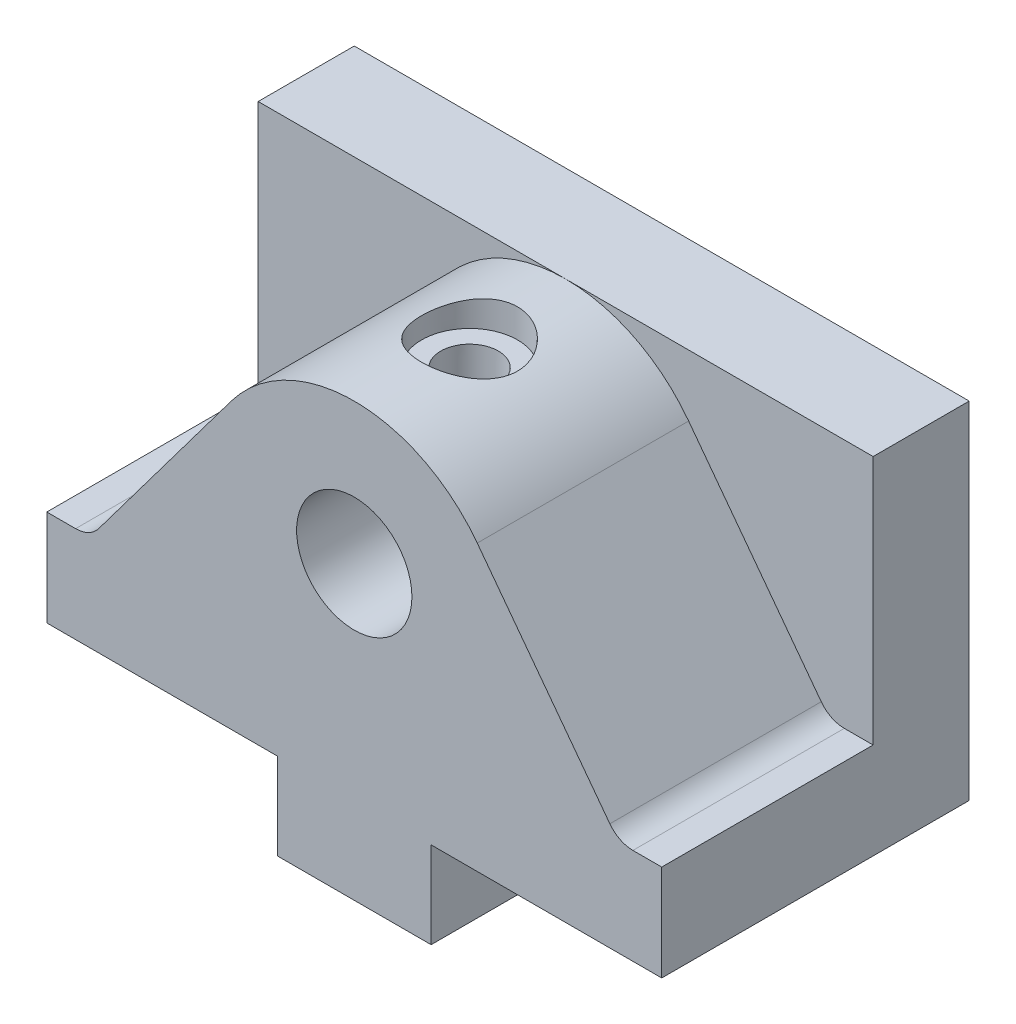
ISO-10303-21;
HEADER;
FILE_DESCRIPTION(('STEP AP214'),'2;1');
FILE_NAME('part.step','',(''),(''),'','','');
FILE_SCHEMA(('AUTOMOTIVE_DESIGN { 1 0 10303 214 1 1 1 1 }'));
ENDSEC;
DATA;
#1=APPLICATION_CONTEXT('core data for automotive mechanical design processes');
#2=APPLICATION_PROTOCOL_DEFINITION('international standard','automotive_design',2000,#1);
#3=PRODUCT_CONTEXT('',#1,'mechanical');
#4=PRODUCT('Part','Part','',(#3));
#5=PRODUCT_RELATED_PRODUCT_CATEGORY('part','',(#4));
#6=PRODUCT_DEFINITION_FORMATION('','',#4);
#7=PRODUCT_DEFINITION_CONTEXT('part definition',#1,'design');
#8=PRODUCT_DEFINITION('design','',#6,#7);
#9=PRODUCT_DEFINITION_SHAPE('','',#8);
#10=(LENGTH_UNIT() NAMED_UNIT(*) SI_UNIT(.MILLI.,.METRE.));
#11=(NAMED_UNIT(*) PLANE_ANGLE_UNIT() SI_UNIT($,.RADIAN.));
#12=(NAMED_UNIT(*) SI_UNIT($,.STERADIAN.) SOLID_ANGLE_UNIT());
#13=UNCERTAINTY_MEASURE_WITH_UNIT(LENGTH_MEASURE(1.E-05),#10,'distance_accuracy_value','');
#14=(GEOMETRIC_REPRESENTATION_CONTEXT(3) GLOBAL_UNCERTAINTY_ASSIGNED_CONTEXT((#13)) GLOBAL_UNIT_ASSIGNED_CONTEXT((#10,
#11,#12)) REPRESENTATION_CONTEXT('',''));
#15=CARTESIAN_POINT('',(0.,0.,0.));
#16=DIRECTION('',(0.,0.,1.));
#17=DIRECTION('',(1.,0.,0.));
#18=AXIS2_PLACEMENT_3D('',#15,#16,#17);
#19=CARTESIAN_POINT('',(-32.,41.,-6.));
#20=DIRECTION('',(0.,0.,-1.));
#21=DIRECTION('',(-1.,0.,0.));
#22=AXIS2_PLACEMENT_3D('',#19,#20,#21);
#23=PLANE('',#22);
#24=DIRECTION('',(-0.6,0.8,0.));
#25=VECTOR('',#24,1.);
#26=CARTESIAN_POINT('',(12.8,34.6,-6.00000000000001));
#27=LINE('',#26,#25);
#28=CARTESIAN_POINT('',(26.6,16.2,-6.00000000000001));
#29=VERTEX_POINT('',#28);
#30=CARTESIAN_POINT('',(12.8,34.6,-6.));
#31=VERTEX_POINT('',#30);
#32=EDGE_CURVE('E230',#29,#31,#27,.T.);
#33=ORIENTED_EDGE('',*,*,#32,.F.);
#34=CARTESIAN_POINT('',(29.,18.,-6.));
#35=DIRECTION('',(0.,0.,-1.));
#36=DIRECTION('',(-1.,0.,0.));
#37=AXIS2_PLACEMENT_3D('',#34,#35,#36);
#38=CIRCLE('',#37,3.);
#39=CARTESIAN_POINT('',(29.,15.,-6.));
#40=VERTEX_POINT('',#39);
#41=EDGE_CURVE('E384',#29,#40,#38,.F.);
#42=ORIENTED_EDGE('',*,*,#41,.T.);
#43=DIRECTION('',(-1.,0.,0.));
#44=VECTOR('',#43,1.);
#45=CARTESIAN_POINT('',(-32.,15.,-6.));
#46=LINE('',#45,#44);
#47=CARTESIAN_POINT('',(32.,15.,-6.));
#48=VERTEX_POINT('',#47);
#49=EDGE_CURVE('E261',#48,#40,#46,.T.);
#50=ORIENTED_EDGE('',*,*,#49,.F.);
#51=DIRECTION('',(0.,-1.,0.));
#52=VECTOR('',#51,1.);
#53=CARTESIAN_POINT('',(32.,41.,-6.));
#54=LINE('',#53,#52);
#55=CARTESIAN_POINT('',(32.,41.,-6.));
#56=VERTEX_POINT('',#55);
#57=EDGE_CURVE('E277',#56,#48,#54,.T.);
#58=ORIENTED_EDGE('',*,*,#57,.F.);
#59=DIRECTION('',(1.,0.,0.));
#60=VECTOR('',#59,1.);
#61=CARTESIAN_POINT('',(-32.,41.,-6.));
#62=LINE('',#61,#60);
#63=CARTESIAN_POINT('',(0.,41.,-6.));
#64=VERTEX_POINT('',#63);
#65=EDGE_CURVE('E267',#64,#56,#62,.T.);
#66=ORIENTED_EDGE('',*,*,#65,.F.);
#67=CARTESIAN_POINT('',(0.,25.,-6.00000000000001));
#68=DIRECTION('',(0.,0.,1.));
#69=DIRECTION('',(1.,0.,0.));
#70=AXIS2_PLACEMENT_3D('',#67,#68,#69);
#71=CIRCLE('',#70,16.);
#72=EDGE_CURVE('E234',#31,#64,#71,.T.);
#73=ORIENTED_EDGE('',*,*,#72,.F.);
#74=EDGE_LOOP('',(#33,#42,#50,#58,#66,#73));
#75=FACE_BOUND('',#74,.T.);
#76=ADVANCED_FACE('F35',(#75),#23,.F.);
#77=CARTESIAN_POINT('',(0.,15.,0.));
#78=DIRECTION('',(0.,1.,0.));
#79=DIRECTION('',(0.,0.,1.));
#80=AXIS2_PLACEMENT_3D('',#77,#78,#79);
#81=PLANE('',#80);
#82=ORIENTED_EDGE('',*,*,#49,.T.);
#83=DIRECTION('',(0.,0.,1.));
#84=VECTOR('',#83,1.);
#85=CARTESIAN_POINT('',(29.,15.,16.));
#86=LINE('',#85,#84);
#87=CARTESIAN_POINT('',(29.,15.,16.));
#88=VERTEX_POINT('',#87);
#89=EDGE_CURVE('E377',#40,#88,#86,.T.);
#90=ORIENTED_EDGE('',*,*,#89,.T.);
#91=DIRECTION('',(1.,0.,0.));
#92=VECTOR('',#91,1.);
#93=CARTESIAN_POINT('',(-32.,15.,16.));
#94=LINE('',#93,#92);
#95=CARTESIAN_POINT('',(32.,15.,16.));
#96=VERTEX_POINT('',#95);
#97=EDGE_CURVE('E254',#88,#96,#94,.T.);
#98=ORIENTED_EDGE('',*,*,#97,.T.);
#99=DIRECTION('',(0.,0.,-1.));
#100=VECTOR('',#99,1.);
#101=CARTESIAN_POINT('',(32.,15.,-6.));
#102=LINE('',#101,#100);
#103=EDGE_CURVE('E258',#96,#48,#102,.T.);
#104=ORIENTED_EDGE('',*,*,#103,.T.);
#105=EDGE_LOOP('',(#82,#90,#98,#104));
#106=FACE_BOUND('',#105,.T.);
#107=ADVANCED_FACE('F339',(#106),#81,.T.);
#108=CARTESIAN_POINT('',(32.,5.,16.));
#109=DIRECTION('',(-1.,0.,0.));
#110=DIRECTION('',(0.,0.,1.));
#111=AXIS2_PLACEMENT_3D('',#108,#109,#110);
#112=PLANE('',#111);
#113=DIRECTION('',(0.,-1.,0.));
#114=VECTOR('',#113,1.);
#115=CARTESIAN_POINT('',(32.,5.,16.));
#116=LINE('',#115,#114);
#117=CARTESIAN_POINT('',(32.,5.,16.));
#118=VERTEX_POINT('',#117);
#119=EDGE_CURVE('E278',#96,#118,#116,.T.);
#120=ORIENTED_EDGE('',*,*,#119,.T.);
#121=DIRECTION('',(0.,0.,1.));
#122=VECTOR('',#121,1.);
#123=CARTESIAN_POINT('',(32.,5.,-17.));
#124=LINE('',#123,#122);
#125=CARTESIAN_POINT('',(32.,5.,-16.));
#126=VERTEX_POINT('',#125);
#127=EDGE_CURVE('E211',#126,#118,#124,.T.);
#128=ORIENTED_EDGE('',*,*,#127,.F.);
#129=DIRECTION('',(0.,-1.,0.));
#130=VECTOR('',#129,1.);
#131=CARTESIAN_POINT('',(32.,5.,-16.));
#132=LINE('',#131,#130);
#133=CARTESIAN_POINT('',(32.,41.,-16.));
#134=VERTEX_POINT('',#133);
#135=EDGE_CURVE('E288',#134,#126,#132,.T.);
#136=ORIENTED_EDGE('',*,*,#135,.F.);
#137=DIRECTION('',(0.,0.,-1.));
#138=VECTOR('',#137,1.);
#139=CARTESIAN_POINT('',(32.,41.,-16.));
#140=LINE('',#139,#138);
#141=EDGE_CURVE('E271',#56,#134,#140,.T.);
#142=ORIENTED_EDGE('',*,*,#141,.F.);
#143=ORIENTED_EDGE('',*,*,#57,.T.);
#144=ORIENTED_EDGE('',*,*,#103,.F.);
#145=EDGE_LOOP('',(#120,#128,#136,#142,#143,#144));
#146=FACE_BOUND('',#145,.T.);
#147=ADVANCED_FACE('F347',(#146),#112,.F.);
#148=CARTESIAN_POINT('',(-32.,5.,-16.));
#149=DIRECTION('',(0.,0.,1.));
#150=DIRECTION('',(1.,0.,0.));
#151=AXIS2_PLACEMENT_3D('',#148,#149,#150);
#152=PLANE('',#151);
#153=DIRECTION('',(0.,1.,0.));
#154=VECTOR('',#153,1.);
#155=CARTESIAN_POINT('',(-8.,5.,-16.));
#156=LINE('',#155,#154);
#157=CARTESIAN_POINT('',(-8.,-4.,-16.));
#158=VERTEX_POINT('',#157);
#159=CARTESIAN_POINT('',(-8.,5.,-16.));
#160=VERTEX_POINT('',#159);
#161=EDGE_CURVE('E223',#158,#160,#156,.T.);
#162=ORIENTED_EDGE('',*,*,#161,.T.);
#163=DIRECTION('',(-1.,0.,0.));
#164=VECTOR('',#163,1.);
#165=CARTESIAN_POINT('',(-32.,5.,-16.));
#166=LINE('',#165,#164);
#167=CARTESIAN_POINT('',(-32.,5.,-16.));
#168=VERTEX_POINT('',#167);
#169=EDGE_CURVE('E226',#160,#168,#166,.T.);
#170=ORIENTED_EDGE('',*,*,#169,.T.);
#171=DIRECTION('',(0.,-1.,0.));
#172=VECTOR('',#171,1.);
#173=CARTESIAN_POINT('',(-32.,5.,-16.));
#174=LINE('',#173,#172);
#175=CARTESIAN_POINT('',(-32.,41.,-16.));
#176=VERTEX_POINT('',#175);
#177=EDGE_CURVE('E285',#176,#168,#174,.T.);
#178=ORIENTED_EDGE('',*,*,#177,.F.);
#179=DIRECTION('',(-1.,0.,0.));
#180=VECTOR('',#179,1.);
#181=CARTESIAN_POINT('',(-32.,41.,-16.));
#182=LINE('',#181,#180);
#183=EDGE_CURVE('E274',#134,#176,#182,.T.);
#184=ORIENTED_EDGE('',*,*,#183,.F.);
#185=ORIENTED_EDGE('',*,*,#135,.T.);
#186=DIRECTION('',(-1.,0.,0.));
#187=VECTOR('',#186,1.);
#188=CARTESIAN_POINT('',(-32.,5.,-16.));
#189=LINE('',#188,#187);
#190=CARTESIAN_POINT('',(8.,5.,-16.));
#191=VERTEX_POINT('',#190);
#192=EDGE_CURVE('E204',#126,#191,#189,.T.);
#193=ORIENTED_EDGE('',*,*,#192,.T.);
#194=DIRECTION('',(0.,-1.,0.));
#195=VECTOR('',#194,1.);
#196=CARTESIAN_POINT('',(8.,5.,-16.));
#197=LINE('',#196,#195);
#198=CARTESIAN_POINT('',(8.,-4.,-16.));
#199=VERTEX_POINT('',#198);
#200=EDGE_CURVE('E217',#191,#199,#197,.T.);
#201=ORIENTED_EDGE('',*,*,#200,.T.);
#202=DIRECTION('',(-1.,0.,0.));
#203=VECTOR('',#202,1.);
#204=CARTESIAN_POINT('',(-32.,-4.,-16.));
#205=LINE('',#204,#203);
#206=EDGE_CURVE('E220',#199,#158,#205,.T.);
#207=ORIENTED_EDGE('',*,*,#206,.T.);
#208=EDGE_LOOP('',(#162,#170,#178,#184,#185,#193,#201,#207));
#209=FACE_BOUND('',#208,.T.);
#210=ADVANCED_FACE('F414',(#209),#152,.F.);
#211=CARTESIAN_POINT('',(-32.,5.,16.));
#212=DIRECTION('',(1.,0.,0.));
#213=DIRECTION('',(0.,0.,-1.));
#214=AXIS2_PLACEMENT_3D('',#211,#212,#213);
#215=PLANE('',#214);
#216=ORIENTED_EDGE('',*,*,#177,.T.);
#217=DIRECTION('',(0.,0.,1.));
#218=VECTOR('',#217,1.);
#219=CARTESIAN_POINT('',(-32.,5.,-17.));
#220=LINE('',#219,#218);
#221=CARTESIAN_POINT('',(-32.,5.,16.));
#222=VERTEX_POINT('',#221);
#223=EDGE_CURVE('E201',#168,#222,#220,.T.);
#224=ORIENTED_EDGE('',*,*,#223,.T.);
#225=DIRECTION('',(0.,-1.,0.));
#226=VECTOR('',#225,1.);
#227=CARTESIAN_POINT('',(-32.,5.,16.));
#228=LINE('',#227,#226);
#229=CARTESIAN_POINT('',(-32.,15.,16.));
#230=VERTEX_POINT('',#229);
#231=EDGE_CURVE('E281',#230,#222,#228,.T.);
#232=ORIENTED_EDGE('',*,*,#231,.F.);
#233=DIRECTION('',(0.,0.,1.));
#234=VECTOR('',#233,1.);
#235=CARTESIAN_POINT('',(-32.,15.,-6.));
#236=LINE('',#235,#234);
#237=CARTESIAN_POINT('',(-32.,15.,-6.));
#238=VERTEX_POINT('',#237);
#239=EDGE_CURVE('E249',#238,#230,#236,.T.);
#240=ORIENTED_EDGE('',*,*,#239,.F.);
#241=DIRECTION('',(0.,-1.,0.));
#242=VECTOR('',#241,1.);
#243=CARTESIAN_POINT('',(-32.,41.,-6.));
#244=LINE('',#243,#242);
#245=CARTESIAN_POINT('',(-32.,41.,-6.));
#246=VERTEX_POINT('',#245);
#247=EDGE_CURVE('E282',#246,#238,#244,.T.);
#248=ORIENTED_EDGE('',*,*,#247,.F.);
#249=DIRECTION('',(0.,0.,1.));
#250=VECTOR('',#249,1.);
#251=CARTESIAN_POINT('',(-32.,41.,-16.));
#252=LINE('',#251,#250);
#253=EDGE_CURVE('E264',#176,#246,#252,.T.);
#254=ORIENTED_EDGE('',*,*,#253,.F.);
#255=EDGE_LOOP('',(#216,#224,#232,#240,#248,#254));
#256=FACE_BOUND('',#255,.T.);
#257=ADVANCED_FACE('F363',(#256),#215,.F.);
#258=CARTESIAN_POINT('',(-32.,5.,16.));
#259=DIRECTION('',(0.,0.,-1.));
#260=DIRECTION('',(-1.,0.,0.));
#261=AXIS2_PLACEMENT_3D('',#258,#259,#260);
#262=PLANE('',#261);
#263=CARTESIAN_POINT('',(0.,26.35,16.));
#264=DIRECTION('',(0.,0.,1.));
#265=DIRECTION('',(1.,0.,0.));
#266=AXIS2_PLACEMENT_3D('',#263,#264,#265);
#267=CIRCLE('',#266,6.);
#268=CARTESIAN_POINT('',(6.,26.35,16.));
#269=VERTEX_POINT('',#268);
#270=EDGE_CURVE('E181',#269,#269,#267,.T.);
#271=ORIENTED_EDGE('',*,*,#270,.F.);
#272=EDGE_LOOP('',(#271));
#273=FACE_BOUND('',#272,.T.);
#274=ORIENTED_EDGE('',*,*,#231,.T.);
#275=DIRECTION('',(-1.,0.,0.));
#276=VECTOR('',#275,1.);
#277=CARTESIAN_POINT('',(-32.,5.,16.));
#278=LINE('',#277,#276);
#279=CARTESIAN_POINT('',(-8.,5.,16.));
#280=VERTEX_POINT('',#279);
#281=EDGE_CURVE('E185',#280,#222,#278,.T.);
#282=ORIENTED_EDGE('',*,*,#281,.F.);
#283=DIRECTION('',(0.,1.,0.));
#284=VECTOR('',#283,1.);
#285=CARTESIAN_POINT('',(-8.,5.,16.));
#286=LINE('',#285,#284);
#287=CARTESIAN_POINT('',(-8.,-4.,16.));
#288=VERTEX_POINT('',#287);
#289=EDGE_CURVE('E198',#288,#280,#286,.T.);
#290=ORIENTED_EDGE('',*,*,#289,.F.);
#291=DIRECTION('',(-1.,0.,0.));
#292=VECTOR('',#291,1.);
#293=CARTESIAN_POINT('',(-8.,-4.,16.));
#294=LINE('',#293,#292);
#295=CARTESIAN_POINT('',(8.,-4.,16.));
#296=VERTEX_POINT('',#295);
#297=EDGE_CURVE('E195',#296,#288,#294,.T.);
#298=ORIENTED_EDGE('',*,*,#297,.F.);
#299=DIRECTION('',(0.,-1.,0.));
#300=VECTOR('',#299,1.);
#301=CARTESIAN_POINT('',(8.,-4.,16.));
#302=LINE('',#301,#300);
#303=CARTESIAN_POINT('',(8.,5.,16.));
#304=VERTEX_POINT('',#303);
#305=EDGE_CURVE('E192',#304,#296,#302,.T.);
#306=ORIENTED_EDGE('',*,*,#305,.F.);
#307=DIRECTION('',(-1.,0.,0.));
#308=VECTOR('',#307,1.);
#309=CARTESIAN_POINT('',(8.,5.,16.));
#310=LINE('',#309,#308);
#311=EDGE_CURVE('E189',#118,#304,#310,.T.);
#312=ORIENTED_EDGE('',*,*,#311,.F.);
#313=ORIENTED_EDGE('',*,*,#119,.F.);
#314=ORIENTED_EDGE('',*,*,#97,.F.);
#315=CARTESIAN_POINT('',(29.,18.,16.));
#316=DIRECTION('',(0.,0.,-1.));
#317=DIRECTION('',(-1.,0.,0.));
#318=AXIS2_PLACEMENT_3D('',#315,#316,#317);
#319=CIRCLE('',#318,3.);
#320=CARTESIAN_POINT('',(26.6,16.2,16.));
#321=VERTEX_POINT('',#320);
#322=EDGE_CURVE('E11',#88,#321,#319,.T.);
#323=ORIENTED_EDGE('',*,*,#322,.T.);
#324=DIRECTION('',(-0.6,0.8,0.));
#325=VECTOR('',#324,1.);
#326=CARTESIAN_POINT('',(12.8,34.6,16.));
#327=LINE('',#326,#325);
#328=CARTESIAN_POINT('',(12.8,34.6,16.));
#329=VERTEX_POINT('',#328);
#330=EDGE_CURVE('E229',#321,#329,#327,.T.);
#331=ORIENTED_EDGE('',*,*,#330,.T.);
#332=CARTESIAN_POINT('',(0.,25.,16.));
#333=DIRECTION('',(0.,0.,1.));
#334=DIRECTION('',(1.,0.,0.));
#335=AXIS2_PLACEMENT_3D('',#332,#333,#334);
#336=CIRCLE('',#335,16.);
#337=CARTESIAN_POINT('',(-12.8,34.6,16.));
#338=VERTEX_POINT('',#337);
#339=EDGE_CURVE('E242',#329,#338,#336,.T.);
#340=ORIENTED_EDGE('',*,*,#339,.T.);
#341=DIRECTION('',(-0.6,-0.8,0.));
#342=VECTOR('',#341,1.);
#343=CARTESIAN_POINT('',(-12.8,34.6,16.));
#344=LINE('',#343,#342);
#345=CARTESIAN_POINT('',(-26.6,16.2,16.));
#346=VERTEX_POINT('',#345);
#347=EDGE_CURVE('E233',#338,#346,#344,.T.);
#348=ORIENTED_EDGE('',*,*,#347,.T.);
#349=CARTESIAN_POINT('',(-29.,18.,16.));
#350=DIRECTION('',(0.,0.,-1.));
#351=DIRECTION('',(-1.,0.,0.));
#352=AXIS2_PLACEMENT_3D('',#349,#350,#351);
#353=CIRCLE('',#352,3.);
#354=CARTESIAN_POINT('',(-29.,15.,16.));
#355=VERTEX_POINT('',#354);
#356=EDGE_CURVE('E43',#346,#355,#353,.T.);
#357=ORIENTED_EDGE('',*,*,#356,.T.);
#358=EDGE_CURVE('E255',#230,#355,#94,.T.);
#359=ORIENTED_EDGE('',*,*,#358,.F.);
#360=EDGE_LOOP('',(#274,#282,#290,#298,#306,#312,#313,#314,#323,#331,#340,#348,#357,#359));
#361=FACE_BOUND('',#360,.T.);
#362=ADVANCED_FACE('F355',(#273,#361),#262,.F.);
#363=CARTESIAN_POINT('',(-29.,15.,-6.));
#364=VERTEX_POINT('',#363);
#365=EDGE_CURVE('E260',#364,#238,#46,.T.);
#366=ORIENTED_EDGE('',*,*,#365,.F.);
#367=CARTESIAN_POINT('',(-29.,18.,-6.));
#368=DIRECTION('',(0.,0.,-1.));
#369=DIRECTION('',(-1.,0.,0.));
#370=AXIS2_PLACEMENT_3D('',#367,#368,#369);
#371=CIRCLE('',#370,3.);
#372=CARTESIAN_POINT('',(-26.6,16.2,-6.00000000000001));
#373=VERTEX_POINT('',#372);
#374=EDGE_CURVE('E367',#364,#373,#371,.F.);
#375=ORIENTED_EDGE('',*,*,#374,.T.);
#376=DIRECTION('',(-0.6,-0.8,0.));
#377=VECTOR('',#376,1.);
#378=CARTESIAN_POINT('',(-12.8,34.6,-6.00000000000001));
#379=LINE('',#378,#377);
#380=CARTESIAN_POINT('',(-12.8,34.6,-6.));
#381=VERTEX_POINT('',#380);
#382=EDGE_CURVE('E237',#381,#373,#379,.T.);
#383=ORIENTED_EDGE('',*,*,#382,.F.);
#384=EDGE_CURVE('E232',#64,#381,#71,.T.);
#385=ORIENTED_EDGE('',*,*,#384,.F.);
#386=EDGE_CURVE('E268',#246,#64,#62,.T.);
#387=ORIENTED_EDGE('',*,*,#386,.F.);
#388=ORIENTED_EDGE('',*,*,#247,.T.);
#389=EDGE_LOOP('',(#366,#375,#383,#385,#387,#388));
#390=FACE_BOUND('',#389,.T.);
#391=ADVANCED_FACE('F342',(#390),#23,.F.);
#392=CARTESIAN_POINT('',(0.,41.,0.));
#393=DIRECTION('',(0.,1.,0.));
#394=DIRECTION('',(0.,0.,1.));
#395=AXIS2_PLACEMENT_3D('',#392,#393,#394);
#396=PLANE('',#395);
#397=ORIENTED_EDGE('',*,*,#253,.T.);
#398=ORIENTED_EDGE('',*,*,#386,.T.);
#399=ORIENTED_EDGE('',*,*,#65,.T.);
#400=ORIENTED_EDGE('',*,*,#141,.T.);
#401=ORIENTED_EDGE('',*,*,#183,.T.);
#402=EDGE_LOOP('',(#397,#398,#399,#400,#401));
#403=FACE_BOUND('',#402,.T.);
#404=ADVANCED_FACE('F354',(#403),#396,.T.);
#405=ORIENTED_EDGE('',*,*,#358,.T.);
#406=DIRECTION('',(0.,0.,1.));
#407=VECTOR('',#406,1.);
#408=CARTESIAN_POINT('',(-29.,15.,-6.));
#409=LINE('',#408,#407);
#410=EDGE_CURVE('E375',#355,#364,#409,.F.);
#411=ORIENTED_EDGE('',*,*,#410,.T.);
#412=ORIENTED_EDGE('',*,*,#365,.T.);
#413=ORIENTED_EDGE('',*,*,#239,.T.);
#414=EDGE_LOOP('',(#405,#411,#412,#413));
#415=FACE_BOUND('',#414,.T.);
#416=ADVANCED_FACE('F350',(#415),#81,.T.);
#417=CARTESIAN_POINT('',(12.8,34.6,-6.00000000000001));
#418=DIRECTION('',(0.8,0.6,0.));
#419=DIRECTION('',(-0.6,0.8,0.));
#420=AXIS2_PLACEMENT_3D('',#417,#418,#419);
#421=PLANE('',#420);
#422=ORIENTED_EDGE('',*,*,#330,.F.);
#423=DIRECTION('',(0.,0.,1.));
#424=VECTOR('',#423,1.);
#425=CARTESIAN_POINT('',(26.6,16.2,-6.));
#426=LINE('',#425,#424);
#427=EDGE_CURVE('E50',#321,#29,#426,.F.);
#428=ORIENTED_EDGE('',*,*,#427,.T.);
#429=ORIENTED_EDGE('',*,*,#32,.T.);
#430=DIRECTION('',(0.,0.,1.));
#431=VECTOR('',#430,1.);
#432=CARTESIAN_POINT('',(12.8,34.6,-6.00000000000001));
#433=LINE('',#432,#431);
#434=EDGE_CURVE('E240',#31,#329,#433,.T.);
#435=ORIENTED_EDGE('',*,*,#434,.T.);
#436=EDGE_LOOP('',(#422,#428,#429,#435));
#437=FACE_BOUND('',#436,.T.);
#438=ADVANCED_FACE('F467',(#437),#421,.T.);
#439=CARTESIAN_POINT('',(-12.8,34.6,-6.00000000000001));
#440=DIRECTION('',(-0.8,0.6,0.));
#441=DIRECTION('',(-0.6,-0.8,0.));
#442=AXIS2_PLACEMENT_3D('',#439,#440,#441);
#443=PLANE('',#442);
#444=ORIENTED_EDGE('',*,*,#382,.T.);
#445=DIRECTION('',(0.,0.,1.));
#446=VECTOR('',#445,1.);
#447=CARTESIAN_POINT('',(-26.6,16.2,16.));
#448=LINE('',#447,#446);
#449=EDGE_CURVE('E291',#373,#346,#448,.T.);
#450=ORIENTED_EDGE('',*,*,#449,.T.);
#451=ORIENTED_EDGE('',*,*,#347,.F.);
#452=DIRECTION('',(0.,0.,1.));
#453=VECTOR('',#452,1.);
#454=CARTESIAN_POINT('',(-12.8,34.6,-6.00000000000001));
#455=LINE('',#454,#453);
#456=EDGE_CURVE('E247',#381,#338,#455,.T.);
#457=ORIENTED_EDGE('',*,*,#456,.F.);
#458=EDGE_LOOP('',(#444,#450,#451,#457));
#459=FACE_BOUND('',#458,.T.);
#460=ADVANCED_FACE('F475',(#459),#443,.T.);
#461=CARTESIAN_POINT('',(0.,25.,-6.00000000000001));
#462=DIRECTION('',(0.,0.,1.));
#463=DIRECTION('',(1.,0.,0.));
#464=AXIS2_PLACEMENT_3D('',#461,#462,#463);
#465=CYLINDRICAL_SURFACE('',#464,16.);
#466=CARTESIAN_POINT('',(-3.66796682288666,40.5738890257447,0.607329849351256));
#467=CARTESIAN_POINT('',(-3.85655415549104,40.5294745982076,0.811224864187316));
#468=CARTESIAN_POINT('',(-4.02817473890282,40.4854332584185,1.03092758181053));
#469=CARTESIAN_POINT('',(-4.33293183524669,40.4029447642242,1.49656247220712));
#470=CARTESIAN_POINT('',(-4.46606775554461,40.364497695971,1.7424950488203));
#471=CARTESIAN_POINT('',(-4.69004570726828,40.297622038454,2.25480624263852));
#472=CARTESIAN_POINT('',(-4.78081015389734,40.2692118502867,2.52122133420603));
#473=CARTESIAN_POINT('',(-4.91643951138088,40.2260885888312,3.06653593579446));
#474=CARTESIAN_POINT('',(-4.96131927802489,40.21137108249,3.34543137458969));
#475=CARTESIAN_POINT('',(-5.00275228367461,40.1977933086947,3.89782050917656));
#476=CARTESIAN_POINT('',(-5.00086291536524,40.1984220089563,4.17118543221788));
#477=CARTESIAN_POINT('',(-4.95265932790622,40.2141969995065,4.71352303427987));
#478=CARTESIAN_POINT('',(-4.90634658042497,40.2293428088689,4.98249585850283));
#479=CARTESIAN_POINT('',(-4.77211202907309,40.2719267196872,5.5040761899871));
#480=CARTESIAN_POINT('',(-4.68487703648901,40.2991615361199,5.75687833085505));
#481=CARTESIAN_POINT('',(-4.4718452406259,40.3627763863686,6.24442736484907));
#482=CARTESIAN_POINT('',(-4.34604075877108,40.3991582409556,6.4791706510912));
#483=CARTESIAN_POINT('',(-4.05386221880599,40.4786923427116,6.93360886435161));
#484=CARTESIAN_POINT('',(-3.88612912720647,40.522049206833,7.15239399033943));
#485=CARTESIAN_POINT('',(-3.51714621075486,40.6097916357537,7.55940674307296));
#486=CARTESIAN_POINT('',(-3.31588857897941,40.6541774380864,7.74762723196419));
#487=CARTESIAN_POINT('',(-2.87738820576906,40.7407803072445,8.09457883429065));
#488=CARTESIAN_POINT('',(-2.63915908314209,40.7828733605562,8.25209815876441));
#489=CARTESIAN_POINT('',(-2.13829349418781,40.8584911314616,8.52471533434713));
#490=CARTESIAN_POINT('',(-1.87566069399767,40.8920171332451,8.63981954457108));
#491=CARTESIAN_POINT('',(-1.33873476430424,40.9461312533402,8.82187666301131));
#492=CARTESIAN_POINT('',(-1.06477380238511,40.9669615185857,8.88973453887428));
#493=CARTESIAN_POINT('',(-0.508667532018523,40.9943319850915,8.97838472749205));
#494=CARTESIAN_POINT('',(-0.226524571763152,41.0008762460307,8.99919041121106));
#495=CARTESIAN_POINT('',(0.325842585700283,40.9989715262755,8.99308388543464));
#496=CARTESIAN_POINT('',(0.596091722753742,40.9911123227242,8.96804875217832));
#497=CARTESIAN_POINT('',(1.12830301167268,40.9623923802865,8.87482225570158));
#498=CARTESIAN_POINT('',(1.39026514982239,40.9415316198825,8.80663082105729));
#499=CARTESIAN_POINT('',(1.89863960138947,40.889005690702,8.62946373639845));
#500=CARTESIAN_POINT('',(2.14506044687401,40.8573465124552,8.52051069605052));
#501=CARTESIAN_POINT('',(2.61643251582556,40.7864235664649,8.2650993545443));
#502=CARTESIAN_POINT('',(2.84137905702392,40.7471581458801,8.11863289946439));
#503=CARTESIAN_POINT('',(3.27291517406224,40.6632777226258,7.7856111128247));
#504=CARTESIAN_POINT('',(3.47843333606935,40.6185129660826,7.59770447809671));
#505=CARTESIAN_POINT('',(3.85559410407518,40.529713974528,7.19030478403674));
#506=CARTESIAN_POINT('',(4.02722960110405,40.4856798945923,6.97080511279371));
#507=CARTESIAN_POINT('',(4.33571732769096,40.4022001949091,6.50001920657609));
#508=CARTESIAN_POINT('',(4.47164450786056,40.3628887210636,6.24810079152894));
#509=CARTESIAN_POINT('',(4.69886772258125,40.2949276618799,5.72354402818869));
#510=CARTESIAN_POINT('',(4.79017615573699,40.2662751151805,5.45091146027934));
#511=CARTESIAN_POINT('',(4.92275537918722,40.2240342090441,4.90152408257693));
#512=CARTESIAN_POINT('',(4.96548021525487,40.2100092017545,4.62515463500765));
#513=CARTESIAN_POINT('',(5.0042052969101,40.1973150930097,4.06884257127003));
#514=CARTESIAN_POINT('',(5.00021766461478,40.1986420076536,3.78890090094679));
#515=CARTESIAN_POINT('',(4.94678936830576,40.2161086592355,3.24502113153351));
#516=CARTESIAN_POINT('',(4.89913560932645,40.2316660144151,2.98088573469236));
#517=CARTESIAN_POINT('',(4.76258749721299,40.2749087949847,2.46455786653337));
#518=CARTESIAN_POINT('',(4.6736886514883,40.3025955415414,2.21236669953067));
#519=CARTESIAN_POINT('',(4.45579853143224,40.3674625704678,1.72259363559533));
#520=CARTESIAN_POINT('',(4.32621270209906,40.4047820741446,1.48529546240047));
#521=CARTESIAN_POINT('',(4.03105187982965,40.4846356718916,1.03520969572654));
#522=CARTESIAN_POINT('',(3.86546750796661,40.5271711236441,0.822428511958623));
#523=CARTESIAN_POINT('',(3.49409961311753,40.615032346554,0.417243749289483));
#524=CARTESIAN_POINT('',(3.28682923537477,40.6603969926424,0.226208801913236));
#525=CARTESIAN_POINT('',(2.8426047421488,40.7470868147152,-0.118713694769998));
#526=CARTESIAN_POINT('',(2.60564856122262,40.7884117092701,-0.27259865711744));
#527=CARTESIAN_POINT('',(2.1063085549053,40.8627725048384,-0.539673431803767));
#528=CARTESIAN_POINT('',(1.84375402108608,40.8957466178422,-0.652562430848433));
#529=CARTESIAN_POINT('',(1.30211291584888,40.9492454737118,-0.832170286852407));
#530=CARTESIAN_POINT('',(1.02303142936766,40.9697740241504,-0.898903265581839));
#531=CARTESIAN_POINT('',(0.467886770182546,40.9954771427218,-0.982029654847181));
#532=CARTESIAN_POINT('',(0.192126760684001,41.0012166393071,-1.00027610119662));
#533=CARTESIAN_POINT('',(-0.358534516756937,40.9983506775733,-0.991099921477244));
#534=CARTESIAN_POINT('',(-0.633435895370321,40.9897471514506,-0.963683446813018));
#535=CARTESIAN_POINT('',(-1.16762038897196,40.9595288267538,-0.865446388170668));
#536=CARTESIAN_POINT('',(-1.42712081414383,40.9382359579645,-0.795698963678337));
#537=CARTESIAN_POINT('',(-1.93066376578296,40.8851089751851,-0.616066690796061));
#538=CARTESIAN_POINT('',(-2.17470490941603,40.8532739197772,-0.50617825772126));
#539=CARTESIAN_POINT('',(-2.64318938431321,40.7819580072738,-0.248501567848817));
#540=CARTESIAN_POINT('',(-2.86746136570034,40.7424183406304,-0.100418762890941));
#541=CARTESIAN_POINT('',(-3.28905847148391,40.6597673082255,0.229329320975597));
#542=CARTESIAN_POINT('',(-3.48637806045092,40.6166552116777,0.411001480422211));
#543=CARTESIAN_POINT('',(-3.66796682288666,40.5738890257447,0.607329849351256));
#544=B_SPLINE_CURVE_WITH_KNOTS('',3,(#466,#467,#468,#469,#470,#471,#472,#473,#474,#475,#476,
#477,#478,#479,#480,#481,#482,#483,#484,#485,#486,#487,#488,#489,#490,#491,#492,#493,#494,#495,
#496,#497,#498,#499,#500,#501,#502,#503,#504,#505,#506,#507,#508,#509,#510,#511,#512,#513,#514,
#515,#516,#517,#518,#519,#520,#521,#522,#523,#524,#525,#526,#527,#528,#529,#530,#531,#532,#533,
#534,#535,#536,#537,#538,#539,#540,#541,#542,#543),.UNSPECIFIED.,.T.,.F.,(4,2,2,2,2,2,2,2,2,2,2,
2,2,2,2,2,2,2,2,2,2,2,2,2,2,2,2,2,2,2,2,2,2,2,2,2,2,2,4),(0.,0.842878534632082,1.68577004825268,
2.53019895271362,3.37435437516618,4.19043878081383,5.00649615195451,5.80932222040629,
6.61230822274298,7.44578312799107,8.27945239816324,9.14130003440096,10.0030184049203,
10.8477400236091,11.6922215650127,12.5028935954864,13.3135669676293,14.1237913401663,
14.9341919728767,15.7764988348789,16.6189822350851,17.481516473694,18.3438108958203,
19.179556256138,20.0150847411973,20.8178784261168,21.6207595752809,22.4359667291507,
23.2513865291451,24.103927220286,24.9565272614513,25.8152626613844,26.6737352086142,
27.4988928798011,28.323939400233,29.1288957874737,29.9339240767613,30.7453565670626,
31.5569554580049),.UNSPECIFIED.);
#545=CARTESIAN_POINT('',(-3.66796682288666,40.5738890257447,0.607329849351256));
#546=VERTEX_POINT('',#545);
#547=EDGE_CURVE('E164',#546,#546,#544,.T.);
#548=ORIENTED_EDGE('',*,*,#547,.F.);
#549=EDGE_LOOP('',(#548));
#550=FACE_BOUND('',#549,.T.);
#551=ORIENTED_EDGE('',*,*,#339,.F.);
#552=ORIENTED_EDGE('',*,*,#434,.F.);
#553=ORIENTED_EDGE('',*,*,#72,.T.);
#554=ORIENTED_EDGE('',*,*,#384,.T.);
#555=ORIENTED_EDGE('',*,*,#456,.T.);
#556=EDGE_LOOP('',(#551,#552,#553,#554,#555));
#557=FACE_BOUND('',#556,.T.);
#558=ADVANCED_FACE('F484',(#550,#557),#465,.T.);
#559=CARTESIAN_POINT('',(-32.,5.,-17.));
#560=DIRECTION('',(0.,1.,0.));
#561=DIRECTION('',(0.,0.,1.));
#562=AXIS2_PLACEMENT_3D('',#559,#560,#561);
#563=PLANE('',#562);
#564=DIRECTION('',(0.,0.,1.));
#565=VECTOR('',#564,1.);
#566=CARTESIAN_POINT('',(-8.,5.,-17.));
#567=LINE('',#566,#565);
#568=EDGE_CURVE('E202',#160,#280,#567,.T.);
#569=ORIENTED_EDGE('',*,*,#568,.T.);
#570=ORIENTED_EDGE('',*,*,#281,.T.);
#571=ORIENTED_EDGE('',*,*,#223,.F.);
#572=ORIENTED_EDGE('',*,*,#169,.F.);
#573=EDGE_LOOP('',(#569,#570,#571,#572));
#574=FACE_BOUND('',#573,.T.);
#575=ADVANCED_FACE('F393',(#574),#563,.F.);
#576=CARTESIAN_POINT('',(-8.,5.,-17.));
#577=DIRECTION('',(1.,0.,0.));
#578=DIRECTION('',(0.,0.,-1.));
#579=AXIS2_PLACEMENT_3D('',#576,#577,#578);
#580=PLANE('',#579);
#581=DIRECTION('',(0.,0.,1.));
#582=VECTOR('',#581,1.);
#583=CARTESIAN_POINT('',(-8.,-4.,-17.));
#584=LINE('',#583,#582);
#585=EDGE_CURVE('E205',#158,#288,#584,.T.);
#586=ORIENTED_EDGE('',*,*,#585,.T.);
#587=ORIENTED_EDGE('',*,*,#289,.T.);
#588=ORIENTED_EDGE('',*,*,#568,.F.);
#589=ORIENTED_EDGE('',*,*,#161,.F.);
#590=EDGE_LOOP('',(#586,#587,#588,#589));
#591=FACE_BOUND('',#590,.T.);
#592=ADVANCED_FACE('F396',(#591),#580,.F.);
#593=CARTESIAN_POINT('',(-8.,-4.,-17.));
#594=DIRECTION('',(0.,1.,0.));
#595=DIRECTION('',(0.,0.,1.));
#596=AXIS2_PLACEMENT_3D('',#593,#594,#595);
#597=PLANE('',#596);
#598=CARTESIAN_POINT('',(0.,-4.,-8.));
#599=DIRECTION('',(0.,-1.,0.));
#600=DIRECTION('',(0.,0.,-1.));
#601=AXIS2_PLACEMENT_3D('',#598,#599,#600);
#602=CIRCLE('',#601,3.);
#603=CARTESIAN_POINT('',(0.,-4.,-11.));
#604=VERTEX_POINT('',#603);
#605=EDGE_CURVE('E163',#604,#604,#602,.T.);
#606=ORIENTED_EDGE('',*,*,#605,.F.);
#607=EDGE_LOOP('',(#606));
#608=FACE_BOUND('',#607,.T.);
#609=CARTESIAN_POINT('',(0.,-4.,8.));
#610=DIRECTION('',(0.,-1.,0.));
#611=DIRECTION('',(0.,0.,-1.));
#612=AXIS2_PLACEMENT_3D('',#609,#610,#611);
#613=CIRCLE('',#612,3.);
#614=CARTESIAN_POINT('',(0.,-4.,5.));
#615=VERTEX_POINT('',#614);
#616=EDGE_CURVE('E178',#615,#615,#613,.T.);
#617=ORIENTED_EDGE('',*,*,#616,.F.);
#618=EDGE_LOOP('',(#617));
#619=FACE_BOUND('',#618,.T.);
#620=DIRECTION('',(0.,0.,1.));
#621=VECTOR('',#620,1.);
#622=CARTESIAN_POINT('',(8.,-4.,-17.));
#623=LINE('',#622,#621);
#624=EDGE_CURVE('E207',#199,#296,#623,.T.);
#625=ORIENTED_EDGE('',*,*,#624,.T.);
#626=ORIENTED_EDGE('',*,*,#297,.T.);
#627=ORIENTED_EDGE('',*,*,#585,.F.);
#628=ORIENTED_EDGE('',*,*,#206,.F.);
#629=EDGE_LOOP('',(#625,#626,#627,#628));
#630=FACE_BOUND('',#629,.T.);
#631=ADVANCED_FACE('F399',(#608,#619,#630),#597,.F.);
#632=CARTESIAN_POINT('',(8.,-4.,-17.));
#633=DIRECTION('',(-1.,0.,0.));
#634=DIRECTION('',(0.,0.,1.));
#635=AXIS2_PLACEMENT_3D('',#632,#633,#634);
#636=PLANE('',#635);
#637=DIRECTION('',(0.,0.,1.));
#638=VECTOR('',#637,1.);
#639=CARTESIAN_POINT('',(8.,5.,-17.));
#640=LINE('',#639,#638);
#641=EDGE_CURVE('E209',#191,#304,#640,.T.);
#642=ORIENTED_EDGE('',*,*,#641,.T.);
#643=ORIENTED_EDGE('',*,*,#305,.T.);
#644=ORIENTED_EDGE('',*,*,#624,.F.);
#645=ORIENTED_EDGE('',*,*,#200,.F.);
#646=EDGE_LOOP('',(#642,#643,#644,#645));
#647=FACE_BOUND('',#646,.T.);
#648=ADVANCED_FACE('F405',(#647),#636,.F.);
#649=CARTESIAN_POINT('',(8.,5.,-17.));
#650=DIRECTION('',(0.,1.,0.));
#651=DIRECTION('',(0.,0.,1.));
#652=AXIS2_PLACEMENT_3D('',#649,#650,#651);
#653=PLANE('',#652);
#654=ORIENTED_EDGE('',*,*,#127,.T.);
#655=ORIENTED_EDGE('',*,*,#311,.T.);
#656=ORIENTED_EDGE('',*,*,#641,.F.);
#657=ORIENTED_EDGE('',*,*,#192,.F.);
#658=EDGE_LOOP('',(#654,#655,#656,#657));
#659=FACE_BOUND('',#658,.T.);
#660=ADVANCED_FACE('F336',(#659),#653,.F.);
#661=CARTESIAN_POINT('',(0.,26.35,-8.));
#662=DIRECTION('',(0.,0.,1.));
#663=DIRECTION('',(1.,0.,0.));
#664=AXIS2_PLACEMENT_3D('',#661,#662,#663);
#665=CYLINDRICAL_SURFACE('',#664,6.);
#666=CARTESIAN_POINT('',(-2.17228207507304,31.9429590188304,1.93495668051628));
#667=CARTESIAN_POINT('',(-2.28590294147616,31.8988268963375,2.05463969501388));
#668=CARTESIAN_POINT('',(-2.38971423988232,31.8545075977372,2.18378134357558));
#669=CARTESIAN_POINT('',(-2.57534574851252,31.7701516407487,2.45856993016285));
#670=CARTESIAN_POINT('',(-2.6571290171592,31.7301222434808,2.60424401928418));
#671=CARTESIAN_POINT('',(-2.79631678962924,31.6591213778755,2.90985048633608));
#672=CARTESIAN_POINT('',(-2.85360750545873,31.6281923912045,3.06984532630991));
#673=CARTESIAN_POINT('',(-2.94047677468444,31.5803083167896,3.39906619659786));
#674=CARTESIAN_POINT('',(-2.97009901961994,31.5633312026267,3.56827722476864));
#675=CARTESIAN_POINT('',(-2.99858195377174,31.5469931216537,3.89453344158444));
#676=CARTESIAN_POINT('',(-2.99999709071706,31.5461694164228,4.05128415607862));
#677=CARTESIAN_POINT('',(-2.97847328597131,31.5585358631155,4.36254510020766));
#678=CARTESIAN_POINT('',(-2.95553194255265,31.5717273970446,4.51705510736933));
#679=CARTESIAN_POINT('',(-2.88844447151177,31.6091098597056,4.81073964973844));
#680=CARTESIAN_POINT('',(-2.845546543973,31.6326493374844,4.95028932290435));
#681=CARTESIAN_POINT('',(-2.74073918137653,31.687774937791,5.22033238412854));
#682=CARTESIAN_POINT('',(-2.67882381079058,31.7193635720132,5.3508229291338));
#683=CARTESIAN_POINT('',(-2.53061015904541,31.7909026161315,5.61308146247724));
#684=CARTESIAN_POINT('',(-2.44249659022767,31.8313726593386,5.74368022594591));
#685=CARTESIAN_POINT('',(-2.24731206846635,31.9142461442681,5.98922059428091));
#686=CARTESIAN_POINT('',(-2.14022890501248,31.9566508181582,6.10415202944042));
#687=CARTESIAN_POINT('',(-1.89703797106335,32.0438195980049,6.32722563480906));
#688=CARTESIAN_POINT('',(-1.75907489014901,32.0883751775677,6.43344119759992));
#689=CARTESIAN_POINT('',(-1.4652958945906,32.170319950321,6.62115814183567));
#690=CARTESIAN_POINT('',(-1.30948383563888,32.2077106865965,6.70266484700783));
#691=CARTESIAN_POINT('',(-0.989059712493417,32.2700958253365,6.83561638055946));
#692=CARTESIAN_POINT('',(-0.824878118017784,32.2954428907144,6.88792549402761));
#693=CARTESIAN_POINT('',(-0.488544009538195,32.3324623096037,6.96371202128267));
#694=CARTESIAN_POINT('',(-0.316398346625282,32.3441461975606,6.98721375504967));
#695=CARTESIAN_POINT('',(0.0124151233773963,32.3520148493568,7.00327220391182));
#696=CARTESIAN_POINT('',(0.168916421499579,32.3496276935307,6.99867844746814));
#697=CARTESIAN_POINT('',(0.478652094989291,32.3328868597318,6.96534703882998));
#698=CARTESIAN_POINT('',(0.631886692357146,32.3185339976072,6.93661103270607));
#699=CARTESIAN_POINT('',(0.927135572367335,32.2797625663165,6.85728455221813));
#700=CARTESIAN_POINT('',(1.06933172388373,32.2555962124863,6.80724025936646));
#701=CARTESIAN_POINT('',(1.34334583225101,32.1993596369387,6.68724169789093));
#702=CARTESIAN_POINT('',(1.47516133431549,32.1672875530582,6.61728273784515));
#703=CARTESIAN_POINT('',(1.73566557237392,32.0951815220793,6.45336418177985));
#704=CARTESIAN_POINT('',(1.86333467317617,32.0547250107466,6.35797282716165));
#705=CARTESIAN_POINT('',(2.10164604647802,31.9713037697378,6.14869242322328));
#706=CARTESIAN_POINT('',(2.21227575638656,31.9283372213781,6.03478985212923));
#707=CARTESIAN_POINT('',(2.42355587960155,31.8400484398047,5.77967249246007));
#708=CARTESIAN_POINT('',(2.52241732890762,31.7948612759328,5.63692342077703));
#709=CARTESIAN_POINT('',(2.69475885023551,31.7116678934944,5.33474999480434));
#710=CARTESIAN_POINT('',(2.76824512958174,31.6736599197721,5.17532973110417));
#711=CARTESIAN_POINT('',(2.85624888514898,31.6266366065343,4.92930622890725));
#712=CARTESIAN_POINT('',(2.88166172471601,31.6127604984451,4.847392248668));
#713=CARTESIAN_POINT('',(2.92546267746741,31.5885397152286,4.68121426888402));
#714=CARTESIAN_POINT('',(2.9438545458983,31.5781931525995,4.59695155154054));
#715=CARTESIAN_POINT('',(2.97332676356569,31.5614890908544,4.42683737030157));
#716=CARTESIAN_POINT('',(2.98441348015646,31.555128118036,4.34098735722292));
#717=CARTESIAN_POINT('',(2.99912674557352,31.5466624189697,4.16847155268648));
#718=CARTESIAN_POINT('',(3.0027542916812,31.5445571237439,4.08180587183909));
#719=CARTESIAN_POINT('',(3.00234770514801,31.5448034933104,3.84384520053472));
#720=CARTESIAN_POINT('',(2.99059774918381,31.5516408848631,3.69247582572438));
#721=CARTESIAN_POINT('',(2.94469057769122,31.5777575855087,3.39437756268797));
#722=CARTESIAN_POINT('',(2.91052768211428,31.5970400485012,3.24764986067122));
#723=CARTESIAN_POINT('',(2.82188919541895,31.6452271516336,2.96419754153411));
#724=CARTESIAN_POINT('',(2.76766327391709,31.6740130727876,2.82737371049343));
#725=CARTESIAN_POINT('',(2.6406291522169,31.7381469813049,2.56433550375605));
#726=CARTESIAN_POINT('',(2.56781410066556,31.7734973868127,2.43812506266184));
#727=CARTESIAN_POINT('',(2.39539472291432,31.8520081587014,2.18360863456221));
#728=CARTESIAN_POINT('',(2.29361143158065,31.8955956705864,2.05690799590695));
#729=CARTESIAN_POINT('',(2.07088822256051,31.9825590423987,1.82144342128483));
#730=CARTESIAN_POINT('',(1.94993662679101,32.025934756576,1.71269050276297));
#731=CARTESIAN_POINT('',(1.6814265290085,32.1114293888311,1.50821013304227));
#732=CARTESIAN_POINT('',(1.5325598614089,32.153216375636,1.41404741772671));
#733=CARTESIAN_POINT('',(1.21871978802342,32.2271286691884,1.25255316109054));
#734=CARTESIAN_POINT('',(1.05375582589602,32.2592595961646,1.18520600455218));
#735=CARTESIAN_POINT('',(0.723531456505979,32.3084012193443,1.08384249833439));
#736=CARTESIAN_POINT('',(0.558971652577076,32.3262510459468,1.04796199742096));
#737=CARTESIAN_POINT('',(0.225306730305603,32.3480926737023,1.00431164832084));
#738=CARTESIAN_POINT('',(0.0562049510324651,32.3520943888079,0.996521689765004));
#739=CARTESIAN_POINT('',(-0.265214096090779,32.346094584854,1.00884275988923));
#740=CARTESIAN_POINT('',(-0.417657657314605,32.3373349475177,1.02647785978492));
#741=CARTESIAN_POINT('',(-0.717132589563809,32.3088883509927,1.08446651321198));
#742=CARTESIAN_POINT('',(-0.864162053505948,32.2891975799063,1.12482799194121));
#743=CARTESIAN_POINT('',(-1.14999321684723,32.2405606555472,1.22697262794716));
#744=CARTESIAN_POINT('',(-1.28873414491815,32.2115542183324,1.28889554054518));
#745=CARTESIAN_POINT('',(-1.55400170638435,32.1468698989807,1.43202802388922));
#746=CARTESIAN_POINT('',(-1.68053952506266,32.1111982159945,1.5132196921307));
#747=CARTESIAN_POINT('',(-1.86661191853097,32.0526898431301,1.65315216801936));
#748=CARTESIAN_POINT('',(-1.93108287988545,32.0311315728931,1.70600043570363));
#749=CARTESIAN_POINT('',(-2.05529346574463,31.9873843913563,1.81675084191706));
#750=CARTESIAN_POINT('',(-2.11503297584653,31.9651954648253,1.87465310257671));
#751=CARTESIAN_POINT('',(-2.17228207507304,31.9429590188304,1.93495668051628));
#752=B_SPLINE_CURVE_WITH_KNOTS('',3,(#666,#667,#668,#669,#670,#671,#672,#673,#674,#675,#676,
#677,#678,#679,#680,#681,#682,#683,#684,#685,#686,#687,#688,#689,#690,#691,#692,#693,#694,#695,
#696,#697,#698,#699,#700,#701,#702,#703,#704,#705,#706,#707,#708,#709,#710,#711,#712,#713,#714,
#715,#716,#717,#718,#719,#720,#721,#722,#723,#724,#725,#726,#727,#728,#729,#730,#731,#732,#733,
#734,#735,#736,#737,#738,#739,#740,#741,#742,#743,#744,#745,#746,#747,#748,#749,#750,#751),
.UNSPECIFIED.,.T.,.F.,(4,2,2,2,2,2,2,2,2,2,2,2,2,2,2,2,2,2,2,2,2,2,2,2,2,2,2,2,2,2,2,2,2,2,2,2,
2,2,2,2,2,2,4),(0.,0.512188845299913,1.02523137075442,1.54063215946002,2.05521769117916,
2.5229668531789,2.9907621429607,3.4325816085771,3.87453911069325,4.36055081162041,
4.84687649703249,5.38342139672165,5.91985061108773,6.43942079557842,6.95855204188918,
7.42596703215961,7.89335015565574,8.34941306871694,8.80558350839083,9.29682724365005,
9.78843144098974,10.3241932357849,10.8598238784673,11.1201461748641,11.3803290391725,
11.6402848204921,11.9002058438011,12.3536584898007,12.8072260974492,13.2553294794492,
13.7035982569246,14.2062815751095,14.7092723334307,15.2495762404784,15.7895650563623,
16.2948451436906,16.7997634228141,17.2587065388758,17.7178097978995,18.1799460041978,
18.6416545114806,18.8997201485189,19.1577920234794),.UNSPECIFIED.);
#753=CARTESIAN_POINT('',(-2.17228207507304,31.9429590188304,1.93495668051628));
#754=VERTEX_POINT('',#753);
#755=EDGE_CURVE('E170',#754,#754,#752,.T.);
#756=ORIENTED_EDGE('',*,*,#755,.T.);
#757=EDGE_LOOP('',(#756));
#758=FACE_BOUND('',#757,.T.);
#759=CARTESIAN_POINT('',(0.,26.35,-8.));
#760=DIRECTION('',(0.,0.,1.));
#761=DIRECTION('',(1.,0.,0.));
#762=AXIS2_PLACEMENT_3D('',#759,#760,#761);
#763=CIRCLE('',#762,6.);
#764=CARTESIAN_POINT('',(6.,26.35,-8.));
#765=VERTEX_POINT('',#764);
#766=EDGE_CURVE('E182',#765,#765,#763,.T.);
#767=ORIENTED_EDGE('',*,*,#766,.F.);
#768=EDGE_LOOP('',(#767));
#769=FACE_BOUND('',#768,.T.);
#770=ORIENTED_EDGE('',*,*,#270,.T.);
#771=EDGE_LOOP('',(#770));
#772=FACE_BOUND('',#771,.T.);
#773=ADVANCED_FACE('F310',(#758,#769,#772),#665,.F.);
#774=CARTESIAN_POINT('',(0.,26.35,-8.));
#775=DIRECTION('',(0.,0.,1.));
#776=DIRECTION('',(1.,0.,0.));
#777=AXIS2_PLACEMENT_3D('',#774,#775,#776);
#778=PLANE('',#777);
#779=ORIENTED_EDGE('',*,*,#766,.T.);
#780=EDGE_LOOP('',(#779));
#781=FACE_BOUND('',#780,.T.);
#782=ADVANCED_FACE('F329',(#781),#778,.T.);
#783=CARTESIAN_POINT('',(0.,-4.,8.));
#784=DIRECTION('',(0.,-1.,0.));
#785=DIRECTION('',(0.,0.,-1.));
#786=AXIS2_PLACEMENT_3D('',#783,#784,#785);
#787=CYLINDRICAL_SURFACE('',#786,3.);
#788=CARTESIAN_POINT('',(0.,12.,8.));
#789=DIRECTION('',(0.,-1.,0.));
#790=DIRECTION('',(0.,0.,-1.));
#791=AXIS2_PLACEMENT_3D('',#788,#789,#790);
#792=CIRCLE('',#791,3.);
#793=CARTESIAN_POINT('',(0.,12.,5.));
#794=VERTEX_POINT('',#793);
#795=EDGE_CURVE('E167',#794,#794,#792,.T.);
#796=ORIENTED_EDGE('',*,*,#795,.F.);
#797=EDGE_LOOP('',(#796));
#798=FACE_BOUND('',#797,.T.);
#799=ORIENTED_EDGE('',*,*,#616,.T.);
#800=EDGE_LOOP('',(#799));
#801=FACE_BOUND('',#800,.T.);
#802=ADVANCED_FACE('F326',(#798,#801),#787,.F.);
#803=CARTESIAN_POINT('',(0.,12.,8.));
#804=DIRECTION('',(0.,-1.,0.));
#805=DIRECTION('',(0.,0.,-1.));
#806=AXIS2_PLACEMENT_3D('',#803,#804,#805);
#807=CONICAL_SURFACE('',#806,3.,1.24904577239825);
#808=CARTESIAN_POINT('',(0.,13.,8.));
#809=VERTEX_POINT('',#808);
#810=VERTEX_LOOP('',#809);
#811=FACE_BOUND('',#810,.T.);
#812=ORIENTED_EDGE('',*,*,#795,.T.);
#813=EDGE_LOOP('',(#812));
#814=FACE_BOUND('',#813,.T.);
#815=ADVANCED_FACE('F323',(#811,#814),#807,.F.);
#816=CARTESIAN_POINT('',(0.,-4.,-8.));
#817=DIRECTION('',(0.,-1.,0.));
#818=DIRECTION('',(0.,0.,-1.));
#819=AXIS2_PLACEMENT_3D('',#816,#817,#818);
#820=CYLINDRICAL_SURFACE('',#819,3.);
#821=CARTESIAN_POINT('',(0.,12.,-8.));
#822=DIRECTION('',(0.,-1.,0.));
#823=DIRECTION('',(0.,0.,-1.));
#824=AXIS2_PLACEMENT_3D('',#821,#822,#823);
#825=CIRCLE('',#824,3.);
#826=CARTESIAN_POINT('',(0.,12.,-11.));
#827=VERTEX_POINT('',#826);
#828=EDGE_CURVE('E161',#827,#827,#825,.T.);
#829=ORIENTED_EDGE('',*,*,#828,.F.);
#830=EDGE_LOOP('',(#829));
#831=FACE_BOUND('',#830,.T.);
#832=ORIENTED_EDGE('',*,*,#605,.T.);
#833=EDGE_LOOP('',(#832));
#834=FACE_BOUND('',#833,.T.);
#835=ADVANCED_FACE('F157',(#831,#834),#820,.F.);
#836=CARTESIAN_POINT('',(0.,12.,-8.));
#837=DIRECTION('',(0.,-1.,0.));
#838=DIRECTION('',(0.,0.,-1.));
#839=AXIS2_PLACEMENT_3D('',#836,#837,#838);
#840=CONICAL_SURFACE('',#839,3.,1.24904577239825);
#841=CARTESIAN_POINT('',(0.,13.,-8.));
#842=VERTEX_POINT('',#841);
#843=VERTEX_LOOP('',#842);
#844=FACE_BOUND('',#843,.T.);
#845=ORIENTED_EDGE('',*,*,#828,.T.);
#846=EDGE_LOOP('',(#845));
#847=FACE_BOUND('',#846,.T.);
#848=ADVANCED_FACE('F153',(#844,#847),#840,.F.);
#849=CARTESIAN_POINT('',(0.00328976852253219,31.0125118611596,4.));
#850=DIRECTION('',(0.000329388961301835,-0.999999945751455,0.));
#851=DIRECTION('',(0.999999945751455,0.000329388961301835,0.));
#852=AXIS2_PLACEMENT_3D('',#849,#850,#851);
#853=CONICAL_SURFACE('',#852,2.99967044829307,0.000329388967258252);
#854=CARTESIAN_POINT('',(0.000984045918501446,38.01251110168,4.));
#855=DIRECTION('',(0.000329388961301835,-0.999999945751455,0.));
#856=DIRECTION('',(0.999999945751455,0.000329388961301835,0.));
#857=AXIS2_PLACEMENT_3D('',#854,#855,#856);
#858=CIRCLE('',#857,2.99736472556395);
#859=CARTESIAN_POINT('',(2.99834860887978,38.0134984005336,4.));
#860=VERTEX_POINT('',#859);
#861=EDGE_CURVE('E566',#860,#860,#858,.T.);
#862=ORIENTED_EDGE('',*,*,#861,.F.);
#863=EDGE_LOOP('',(#862));
#864=FACE_BOUND('',#863,.T.);
#865=ORIENTED_EDGE('',*,*,#755,.F.);
#866=EDGE_LOOP('',(#865));
#867=FACE_BOUND('',#866,.T.);
#868=ADVANCED_FACE('F156',(#864,#867),#853,.F.);
#869=CARTESIAN_POINT('',(0.000983828924325791,38.0131698795669,4.));
#870=DIRECTION('',(0.000329388961301835,-0.999999945751455,0.));
#871=DIRECTION('',(0.999999945751455,0.000329388961301835,0.));
#872=AXIS2_PLACEMENT_3D('',#869,#870,#871);
#873=CONICAL_SURFACE('',#872,4.99736461706684,0.000329388967258127);
#874=ORIENTED_EDGE('',*,*,#547,.T.);
#875=EDGE_LOOP('',(#874));
#876=FACE_BOUND('',#875,.T.);
#877=CARTESIAN_POINT('',(0.000983828924325791,38.0131698795669,4.));
#878=DIRECTION('',(0.000329388961301835,-0.999999945751455,0.));
#879=DIRECTION('',(0.999999945751455,0.000329388961301835,0.));
#880=AXIS2_PLACEMENT_3D('',#877,#878,#879);
#881=CIRCLE('',#880,4.99736461706684);
#882=CARTESIAN_POINT('',(4.99834817489141,38.0148159563073,4.));
#883=VERTEX_POINT('',#882);
#884=EDGE_CURVE('E173',#883,#883,#881,.T.);
#885=ORIENTED_EDGE('',*,*,#884,.T.);
#886=EDGE_LOOP('',(#885));
#887=FACE_BOUND('',#886,.T.);
#888=ADVANCED_FACE('F316',(#876,#887),#873,.F.);
#889=CARTESIAN_POINT('',(0.000984045918501446,38.01251110168,4.));
#890=DIRECTION('',(-0.000329388961301835,0.999999945751455,0.));
#891=DIRECTION('',(-0.999999945751455,-0.000329388961301835,0.));
#892=AXIS2_PLACEMENT_3D('',#889,#890,#891);
#893=CONICAL_SURFACE('',#892,2.99736472556395,1.57046693782764);
#894=ORIENTED_EDGE('',*,*,#884,.F.);
#895=EDGE_LOOP('',(#894));
#896=FACE_BOUND('',#895,.T.);
#897=ORIENTED_EDGE('',*,*,#861,.T.);
#898=EDGE_LOOP('',(#897));
#899=FACE_BOUND('',#898,.T.);
#900=ADVANCED_FACE('F426',(#896,#899),#893,.F.);
#901=CARTESIAN_POINT('',(-29.,18.,-6.00000000000001));
#902=DIRECTION('',(0.,0.,-1.));
#903=DIRECTION('',(-1.,0.,0.));
#904=AXIS2_PLACEMENT_3D('',#901,#902,#903);
#905=CYLINDRICAL_SURFACE('',#904,3.);
#906=ORIENTED_EDGE('',*,*,#374,.F.);
#907=ORIENTED_EDGE('',*,*,#410,.F.);
#908=ORIENTED_EDGE('',*,*,#356,.F.);
#909=ORIENTED_EDGE('',*,*,#449,.F.);
#910=EDGE_LOOP('',(#906,#907,#908,#909));
#911=FACE_BOUND('',#910,.T.);
#912=ADVANCED_FACE('F374',(#911),#905,.F.);
#913=CARTESIAN_POINT('',(29.,18.,0.));
#914=DIRECTION('',(0.,0.,-1.));
#915=DIRECTION('',(-1.,0.,0.));
#916=AXIS2_PLACEMENT_3D('',#913,#914,#915);
#917=CYLINDRICAL_SURFACE('',#916,3.);
#918=ORIENTED_EDGE('',*,*,#41,.F.);
#919=ORIENTED_EDGE('',*,*,#427,.F.);
#920=ORIENTED_EDGE('',*,*,#322,.F.);
#921=ORIENTED_EDGE('',*,*,#89,.F.);
#922=EDGE_LOOP('',(#918,#919,#920,#921));
#923=FACE_BOUND('',#922,.T.);
#924=ADVANCED_FACE('F37',(#923),#917,.F.);
#925=CLOSED_SHELL('',(#76,#107,#147,#210,#257,#362,#391,#404,#416,#438,#460,#558,#575,#592,#631,
#648,#660,#773,#782,#802,#815,#835,#848,#868,#888,#900,#912,#924));
#926=MANIFOLD_SOLID_BREP('B2',#925);
#927=ADVANCED_BREP_SHAPE_REPRESENTATION('',(#18,#926),#14);
#928=SHAPE_DEFINITION_REPRESENTATION(#9,#927);
ENDSEC;
END-ISO-10303-21;
